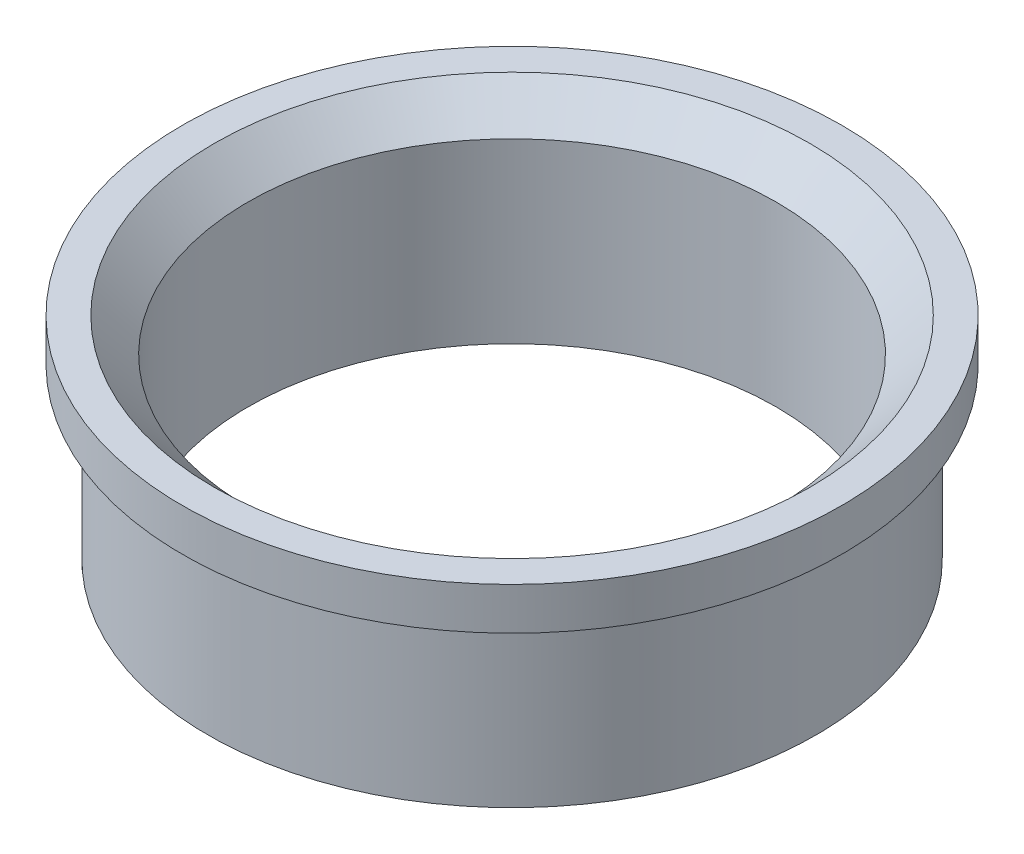
ISO-10303-21;
HEADER;
FILE_DESCRIPTION(('STEP AP214'),'2;1');
FILE_NAME('part.step','',(''),(''),'','','');
FILE_SCHEMA(('AUTOMOTIVE_DESIGN { 1 0 10303 214 1 1 1 1 }'));
ENDSEC;
DATA;
#1=APPLICATION_CONTEXT('core data for automotive mechanical design processes');
#2=APPLICATION_PROTOCOL_DEFINITION('international standard','automotive_design',2000,#1);
#3=PRODUCT_CONTEXT('',#1,'mechanical');
#4=PRODUCT('Part','Part','',(#3));
#5=PRODUCT_RELATED_PRODUCT_CATEGORY('part','',(#4));
#6=PRODUCT_DEFINITION_FORMATION('','',#4);
#7=PRODUCT_DEFINITION_CONTEXT('part definition',#1,'design');
#8=PRODUCT_DEFINITION('design','',#6,#7);
#9=PRODUCT_DEFINITION_SHAPE('','',#8);
#10=(LENGTH_UNIT() NAMED_UNIT(*) SI_UNIT(.MILLI.,.METRE.));
#11=(NAMED_UNIT(*) PLANE_ANGLE_UNIT() SI_UNIT($,.RADIAN.));
#12=(NAMED_UNIT(*) SI_UNIT($,.STERADIAN.) SOLID_ANGLE_UNIT());
#13=UNCERTAINTY_MEASURE_WITH_UNIT(LENGTH_MEASURE(1.E-05),#10,'distance_accuracy_value','');
#14=(GEOMETRIC_REPRESENTATION_CONTEXT(3) GLOBAL_UNCERTAINTY_ASSIGNED_CONTEXT((#13)) GLOBAL_UNIT_ASSIGNED_CONTEXT((#10,
#11,#12)) REPRESENTATION_CONTEXT('',''));
#15=CARTESIAN_POINT('',(0.,0.,0.));
#16=DIRECTION('',(0.,0.,1.));
#17=DIRECTION('',(1.,0.,0.));
#18=AXIS2_PLACEMENT_3D('',#15,#16,#17);
#19=CARTESIAN_POINT('',(72.,0.,0.));
#20=DIRECTION('',(0.,-1.,0.));
#21=DIRECTION('',(0.,0.,-1.));
#22=AXIS2_PLACEMENT_3D('',#19,#20,#21);
#23=PLANE('',#22);
#24=CARTESIAN_POINT('',(0.,0.,0.));
#25=DIRECTION('',(0.,-1.,0.));
#26=DIRECTION('',(0.,0.,-1.));
#27=AXIS2_PLACEMENT_3D('',#24,#25,#26);
#28=CIRCLE('',#27,72.);
#29=CARTESIAN_POINT('',(0.,0.,-72.));
#30=VERTEX_POINT('',#29);
#31=EDGE_CURVE('E66',#30,#30,#28,.T.);
#32=ORIENTED_EDGE('',*,*,#31,.T.);
#33=EDGE_LOOP('',(#32));
#34=FACE_BOUND('',#33,.T.);
#35=CARTESIAN_POINT('',(0.,0.,0.));
#36=DIRECTION('',(0.,-1.,0.));
#37=DIRECTION('',(0.,0.,-1.));
#38=AXIS2_PLACEMENT_3D('',#35,#36,#37);
#39=CIRCLE('',#38,62.5);
#40=CARTESIAN_POINT('',(0.,0.,-62.5));
#41=VERTEX_POINT('',#40);
#42=EDGE_CURVE('E10',#41,#41,#39,.T.);
#43=ORIENTED_EDGE('',*,*,#42,.F.);
#44=EDGE_LOOP('',(#43));
#45=FACE_BOUND('',#44,.T.);
#46=ADVANCED_FACE('F41',(#34,#45),#23,.T.);
#47=CARTESIAN_POINT('',(0.,0.,0.));
#48=DIRECTION('',(0.,-1.,0.));
#49=DIRECTION('',(0.,0.,-1.));
#50=AXIS2_PLACEMENT_3D('',#47,#48,#49);
#51=CYLINDRICAL_SURFACE('',#50,62.5);
#52=ORIENTED_EDGE('',*,*,#42,.T.);
#53=EDGE_LOOP('',(#52));
#54=FACE_BOUND('',#53,.T.);
#55=CARTESIAN_POINT('',(0.,42.,0.));
#56=DIRECTION('',(0.,-1.,0.));
#57=DIRECTION('',(0.,0.,-1.));
#58=AXIS2_PLACEMENT_3D('',#55,#56,#57);
#59=CIRCLE('',#58,62.5);
#60=CARTESIAN_POINT('',(0.,42.,-62.5));
#61=VERTEX_POINT('',#60);
#62=EDGE_CURVE('E47',#61,#61,#59,.T.);
#63=ORIENTED_EDGE('',*,*,#62,.F.);
#64=EDGE_LOOP('',(#63));
#65=FACE_BOUND('',#64,.T.);
#66=ADVANCED_FACE('F84',(#54,#65),#51,.F.);
#67=CARTESIAN_POINT('',(0.,50.,0.));
#68=DIRECTION('',(0.,1.,0.));
#69=DIRECTION('',(0.,0.,1.));
#70=AXIS2_PLACEMENT_3D('',#67,#68,#69);
#71=CONICAL_SURFACE('',#70,70.5,0.78539816339745);
#72=ORIENTED_EDGE('',*,*,#62,.T.);
#73=EDGE_LOOP('',(#72));
#74=FACE_BOUND('',#73,.T.);
#75=CARTESIAN_POINT('',(0.,50.,0.));
#76=DIRECTION('',(0.,-1.,0.));
#77=DIRECTION('',(0.,0.,-1.));
#78=AXIS2_PLACEMENT_3D('',#75,#76,#77);
#79=CIRCLE('',#78,70.5);
#80=CARTESIAN_POINT('',(0.,50.,-70.5));
#81=VERTEX_POINT('',#80);
#82=EDGE_CURVE('E51',#81,#81,#79,.T.);
#83=ORIENTED_EDGE('',*,*,#82,.F.);
#84=EDGE_LOOP('',(#83));
#85=FACE_BOUND('',#84,.T.);
#86=ADVANCED_FACE('F88',(#74,#85),#71,.F.);
#87=CARTESIAN_POINT('',(70.5,50.,0.));
#88=DIRECTION('',(0.,1.,0.));
#89=DIRECTION('',(0.,0.,1.));
#90=AXIS2_PLACEMENT_3D('',#87,#88,#89);
#91=PLANE('',#90);
#92=ORIENTED_EDGE('',*,*,#82,.T.);
#93=EDGE_LOOP('',(#92));
#94=FACE_BOUND('',#93,.T.);
#95=CARTESIAN_POINT('',(0.,50.,0.));
#96=DIRECTION('',(0.,-1.,0.));
#97=DIRECTION('',(0.,0.,-1.));
#98=AXIS2_PLACEMENT_3D('',#95,#96,#97);
#99=CIRCLE('',#98,78.);
#100=CARTESIAN_POINT('',(0.,50.,-78.));
#101=VERTEX_POINT('',#100);
#102=EDGE_CURVE('E55',#101,#101,#99,.T.);
#103=ORIENTED_EDGE('',*,*,#102,.F.);
#104=EDGE_LOOP('',(#103));
#105=FACE_BOUND('',#104,.T.);
#106=ADVANCED_FACE('F92',(#94,#105),#91,.T.);
#107=CARTESIAN_POINT('',(0.,0.,0.));
#108=DIRECTION('',(0.,-1.,0.));
#109=DIRECTION('',(0.,0.,-1.));
#110=AXIS2_PLACEMENT_3D('',#107,#108,#109);
#111=CYLINDRICAL_SURFACE('',#110,78.);
#112=ORIENTED_EDGE('',*,*,#102,.T.);
#113=EDGE_LOOP('',(#112));
#114=FACE_BOUND('',#113,.T.);
#115=CARTESIAN_POINT('',(0.,40.,0.));
#116=DIRECTION('',(0.,-1.,0.));
#117=DIRECTION('',(0.,0.,-1.));
#118=AXIS2_PLACEMENT_3D('',#115,#116,#117);
#119=CIRCLE('',#118,78.);
#120=CARTESIAN_POINT('',(0.,40.,-78.));
#121=VERTEX_POINT('',#120);
#122=EDGE_CURVE('E60',#121,#121,#119,.T.);
#123=ORIENTED_EDGE('',*,*,#122,.F.);
#124=EDGE_LOOP('',(#123));
#125=FACE_BOUND('',#124,.T.);
#126=ADVANCED_FACE('F80',(#114,#125),#111,.T.);
#127=CARTESIAN_POINT('',(78.,40.,0.));
#128=DIRECTION('',(0.,-1.,0.));
#129=DIRECTION('',(0.,0.,-1.));
#130=AXIS2_PLACEMENT_3D('',#127,#128,#129);
#131=PLANE('',#130);
#132=ORIENTED_EDGE('',*,*,#122,.T.);
#133=EDGE_LOOP('',(#132));
#134=FACE_BOUND('',#133,.T.);
#135=CARTESIAN_POINT('',(0.,40.,0.));
#136=DIRECTION('',(0.,-1.,0.));
#137=DIRECTION('',(0.,0.,-1.));
#138=AXIS2_PLACEMENT_3D('',#135,#136,#137);
#139=CIRCLE('',#138,72.);
#140=CARTESIAN_POINT('',(0.,40.,-72.));
#141=VERTEX_POINT('',#140);
#142=EDGE_CURVE('E63',#141,#141,#139,.T.);
#143=ORIENTED_EDGE('',*,*,#142,.F.);
#144=EDGE_LOOP('',(#143));
#145=FACE_BOUND('',#144,.T.);
#146=ADVANCED_FACE('F74',(#134,#145),#131,.T.);
#147=CARTESIAN_POINT('',(0.,0.,0.));
#148=DIRECTION('',(0.,-1.,0.));
#149=DIRECTION('',(0.,0.,-1.));
#150=AXIS2_PLACEMENT_3D('',#147,#148,#149);
#151=CYLINDRICAL_SURFACE('',#150,72.);
#152=ORIENTED_EDGE('',*,*,#142,.T.);
#153=EDGE_LOOP('',(#152));
#154=FACE_BOUND('',#153,.T.);
#155=ORIENTED_EDGE('',*,*,#31,.F.);
#156=EDGE_LOOP('',(#155));
#157=FACE_BOUND('',#156,.T.);
#158=ADVANCED_FACE('F72',(#154,#157),#151,.T.);
#159=CLOSED_SHELL('',(#46,#66,#86,#106,#126,#146,#158));
#160=MANIFOLD_SOLID_BREP('B2',#159);
#161=ADVANCED_BREP_SHAPE_REPRESENTATION('',(#18,#160),#14);
#162=SHAPE_DEFINITION_REPRESENTATION(#9,#161);
ENDSEC;
END-ISO-10303-21;
